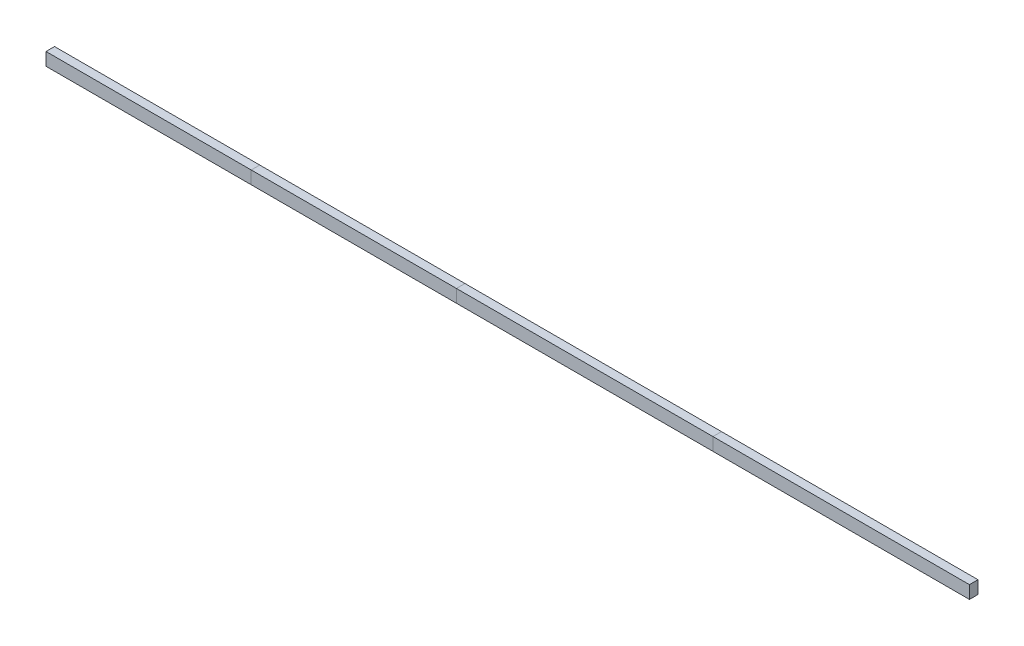
ISO-10303-21;
HEADER;
FILE_DESCRIPTION(('STEP AP214'),'2;1');
FILE_NAME('part.step','',(''),(''),'','','');
FILE_SCHEMA(('AUTOMOTIVE_DESIGN { 1 0 10303 214 1 1 1 1 }'));
ENDSEC;
DATA;
#1=APPLICATION_CONTEXT('core data for automotive mechanical design processes');
#2=APPLICATION_PROTOCOL_DEFINITION('international standard','automotive_design',2000,#1);
#3=PRODUCT_CONTEXT('',#1,'mechanical');
#4=PRODUCT('Part','Part','',(#3));
#5=PRODUCT_RELATED_PRODUCT_CATEGORY('part','',(#4));
#6=PRODUCT_DEFINITION_FORMATION('','',#4);
#7=PRODUCT_DEFINITION_CONTEXT('part definition',#1,'design');
#8=PRODUCT_DEFINITION('design','',#6,#7);
#9=PRODUCT_DEFINITION_SHAPE('','',#8);
#10=(LENGTH_UNIT() NAMED_UNIT(*) SI_UNIT(.MILLI.,.METRE.));
#11=(NAMED_UNIT(*) PLANE_ANGLE_UNIT() SI_UNIT($,.RADIAN.));
#12=(NAMED_UNIT(*) SI_UNIT($,.STERADIAN.) SOLID_ANGLE_UNIT());
#13=UNCERTAINTY_MEASURE_WITH_UNIT(LENGTH_MEASURE(1.E-05),#10,'distance_accuracy_value','');
#14=(GEOMETRIC_REPRESENTATION_CONTEXT(3) GLOBAL_UNCERTAINTY_ASSIGNED_CONTEXT((#13)) GLOBAL_UNIT_ASSIGNED_CONTEXT((#10,
#11,#12)) REPRESENTATION_CONTEXT('',''));
#15=CARTESIAN_POINT('',(0.,0.,0.));
#16=DIRECTION('',(0.,0.,1.));
#17=DIRECTION('',(1.,0.,0.));
#18=AXIS2_PLACEMENT_3D('',#15,#16,#17);
#19=CARTESIAN_POINT('',(5486.4,-38.1,-25.4));
#20=DIRECTION('',(0.,0.,1.));
#21=DIRECTION('',(1.,0.,0.));
#22=AXIS2_PLACEMENT_3D('',#19,#20,#21);
#23=PLANE('',#22);
#24=DIRECTION('',(0.,1.,0.));
#25=VECTOR('',#24,1.);
#26=CARTESIAN_POINT('',(3962.4,-38.1,-25.4));
#27=LINE('',#26,#25);
#28=CARTESIAN_POINT('',(3962.4,-38.1,-25.4));
#29=VERTEX_POINT('',#28);
#30=CARTESIAN_POINT('',(3962.4,38.1,-25.4));
#31=VERTEX_POINT('',#30);
#32=EDGE_CURVE('E115',#29,#31,#27,.T.);
#33=ORIENTED_EDGE('',*,*,#32,.T.);
#34=DIRECTION('',(-1.,0.,0.));
#35=VECTOR('',#34,1.);
#36=CARTESIAN_POINT('',(5486.4,38.1,-25.4));
#37=LINE('',#36,#35);
#38=CARTESIAN_POINT('',(5486.4,38.1,-25.4));
#39=VERTEX_POINT('',#38);
#40=EDGE_CURVE('E12',#39,#31,#37,.T.);
#41=ORIENTED_EDGE('',*,*,#40,.F.);
#42=DIRECTION('',(0.,1.,0.));
#43=VECTOR('',#42,1.);
#44=CARTESIAN_POINT('',(5486.4,-38.1,-25.4));
#45=LINE('',#44,#43);
#46=CARTESIAN_POINT('',(5486.4,-38.1,-25.4));
#47=VERTEX_POINT('',#46);
#48=EDGE_CURVE('E103',#47,#39,#45,.T.);
#49=ORIENTED_EDGE('',*,*,#48,.F.);
#50=DIRECTION('',(-1.,0.,0.));
#51=VECTOR('',#50,1.);
#52=CARTESIAN_POINT('',(5486.4,-38.1,-25.4));
#53=LINE('',#52,#51);
#54=EDGE_CURVE('E111',#47,#29,#53,.T.);
#55=ORIENTED_EDGE('',*,*,#54,.T.);
#56=EDGE_LOOP('',(#33,#41,#49,#55));
#57=FACE_BOUND('',#56,.T.);
#58=ADVANCED_FACE('F52',(#57),#23,.F.);
#59=CARTESIAN_POINT('',(5486.4,38.1,25.4));
#60=DIRECTION('',(0.,-1.,0.));
#61=DIRECTION('',(0.,0.,-1.));
#62=AXIS2_PLACEMENT_3D('',#59,#60,#61);
#63=PLANE('',#62);
#64=DIRECTION('',(0.,0.,1.));
#65=VECTOR('',#64,1.);
#66=CARTESIAN_POINT('',(3962.4,38.1,25.4));
#67=LINE('',#66,#65);
#68=CARTESIAN_POINT('',(3962.4,38.1,25.4));
#69=VERTEX_POINT('',#68);
#70=EDGE_CURVE('E107',#31,#69,#67,.T.);
#71=ORIENTED_EDGE('',*,*,#70,.T.);
#72=DIRECTION('',(-1.,0.,0.));
#73=VECTOR('',#72,1.);
#74=CARTESIAN_POINT('',(5486.4,38.1,25.4));
#75=LINE('',#74,#73);
#76=CARTESIAN_POINT('',(5486.4,38.1,25.4));
#77=VERTEX_POINT('',#76);
#78=EDGE_CURVE('E60',#77,#69,#75,.T.);
#79=ORIENTED_EDGE('',*,*,#78,.F.);
#80=DIRECTION('',(0.,0.,1.));
#81=VECTOR('',#80,1.);
#82=CARTESIAN_POINT('',(5486.4,38.1,25.4));
#83=LINE('',#82,#81);
#84=EDGE_CURVE('E98',#39,#77,#83,.T.);
#85=ORIENTED_EDGE('',*,*,#84,.F.);
#86=ORIENTED_EDGE('',*,*,#40,.T.);
#87=EDGE_LOOP('',(#71,#79,#85,#86));
#88=FACE_BOUND('',#87,.T.);
#89=ADVANCED_FACE('F106',(#88),#63,.F.);
#90=CARTESIAN_POINT('',(5486.4,-38.1,25.4));
#91=DIRECTION('',(0.,0.,-1.));
#92=DIRECTION('',(-1.,0.,0.));
#93=AXIS2_PLACEMENT_3D('',#90,#91,#92);
#94=PLANE('',#93);
#95=DIRECTION('',(0.,-1.,0.));
#96=VECTOR('',#95,1.);
#97=CARTESIAN_POINT('',(3962.4,-38.1,25.4));
#98=LINE('',#97,#96);
#99=CARTESIAN_POINT('',(3962.4,-38.1,25.4));
#100=VERTEX_POINT('',#99);
#101=EDGE_CURVE('E85',#69,#100,#98,.T.);
#102=ORIENTED_EDGE('',*,*,#101,.T.);
#103=DIRECTION('',(-1.,0.,0.));
#104=VECTOR('',#103,1.);
#105=CARTESIAN_POINT('',(5486.4,-38.1,25.4));
#106=LINE('',#105,#104);
#107=CARTESIAN_POINT('',(5486.4,-38.1,25.4));
#108=VERTEX_POINT('',#107);
#109=EDGE_CURVE('E108',#108,#100,#106,.T.);
#110=ORIENTED_EDGE('',*,*,#109,.F.);
#111=DIRECTION('',(0.,-1.,0.));
#112=VECTOR('',#111,1.);
#113=CARTESIAN_POINT('',(5486.4,-38.1,25.4));
#114=LINE('',#113,#112);
#115=EDGE_CURVE('E101',#77,#108,#114,.T.);
#116=ORIENTED_EDGE('',*,*,#115,.F.);
#117=ORIENTED_EDGE('',*,*,#78,.T.);
#118=EDGE_LOOP('',(#102,#110,#116,#117));
#119=FACE_BOUND('',#118,.T.);
#120=ADVANCED_FACE('F109',(#119),#94,.F.);
#121=CARTESIAN_POINT('',(5486.4,-38.1,25.4));
#122=DIRECTION('',(0.,1.,0.));
#123=DIRECTION('',(0.,0.,1.));
#124=AXIS2_PLACEMENT_3D('',#121,#122,#123);
#125=PLANE('',#124);
#126=DIRECTION('',(0.,0.,-1.));
#127=VECTOR('',#126,1.);
#128=CARTESIAN_POINT('',(3962.4,-38.1,25.4));
#129=LINE('',#128,#127);
#130=EDGE_CURVE('E91',#100,#29,#129,.T.);
#131=ORIENTED_EDGE('',*,*,#130,.T.);
#132=ORIENTED_EDGE('',*,*,#54,.F.);
#133=DIRECTION('',(0.,0.,-1.));
#134=VECTOR('',#133,1.);
#135=CARTESIAN_POINT('',(5486.4,-38.1,25.4));
#136=LINE('',#135,#134);
#137=EDGE_CURVE('E68',#108,#47,#136,.T.);
#138=ORIENTED_EDGE('',*,*,#137,.F.);
#139=ORIENTED_EDGE('',*,*,#109,.T.);
#140=EDGE_LOOP('',(#131,#132,#138,#139));
#141=FACE_BOUND('',#140,.T.);
#142=ADVANCED_FACE('F122',(#141),#125,.F.);
#143=CARTESIAN_POINT('',(5486.4,0.,0.));
#144=DIRECTION('',(-1.,0.,0.));
#145=DIRECTION('',(0.,0.,1.));
#146=AXIS2_PLACEMENT_3D('',#143,#144,#145);
#147=PLANE('',#146);
#148=ORIENTED_EDGE('',*,*,#48,.T.);
#149=ORIENTED_EDGE('',*,*,#84,.T.);
#150=ORIENTED_EDGE('',*,*,#115,.T.);
#151=ORIENTED_EDGE('',*,*,#137,.T.);
#152=EDGE_LOOP('',(#148,#149,#150,#151));
#153=FACE_BOUND('',#152,.T.);
#154=ADVANCED_FACE('F99',(#153),#147,.F.);
#155=CARTESIAN_POINT('',(3962.4,0.,0.));
#156=DIRECTION('',(-1.,0.,0.));
#157=DIRECTION('',(0.,0.,1.));
#158=AXIS2_PLACEMENT_3D('',#155,#156,#157);
#159=PLANE('',#158);
#160=ORIENTED_EDGE('',*,*,#32,.F.);
#161=ORIENTED_EDGE('',*,*,#130,.F.);
#162=ORIENTED_EDGE('',*,*,#101,.F.);
#163=ORIENTED_EDGE('',*,*,#70,.F.);
#164=EDGE_LOOP('',(#160,#161,#162,#163));
#165=FACE_BOUND('',#164,.T.);
#166=ADVANCED_FACE('F125',(#165),#159,.T.);
#167=CLOSED_SHELL('',(#58,#89,#120,#142,#154,#166));
#168=MANIFOLD_SOLID_BREP('B2',#167);
#169=CARTESIAN_POINT('',(3962.4,-38.1,-25.4));
#170=DIRECTION('',(0.,0.,1.));
#171=DIRECTION('',(1.,0.,0.));
#172=AXIS2_PLACEMENT_3D('',#169,#170,#171);
#173=PLANE('',#172);
#174=DIRECTION('',(0.,1.,0.));
#175=VECTOR('',#174,1.);
#176=CARTESIAN_POINT('',(2438.4,-38.1,-25.4));
#177=LINE('',#176,#175);
#178=CARTESIAN_POINT('',(2438.4,-38.1,-25.4));
#179=VERTEX_POINT('',#178);
#180=CARTESIAN_POINT('',(2438.4,38.1,-25.4));
#181=VERTEX_POINT('',#180);
#182=EDGE_CURVE('E254',#179,#181,#177,.T.);
#183=ORIENTED_EDGE('',*,*,#182,.T.);
#184=DIRECTION('',(-1.,0.,0.));
#185=VECTOR('',#184,1.);
#186=CARTESIAN_POINT('',(3962.4,38.1,-25.4));
#187=LINE('',#186,#185);
#188=CARTESIAN_POINT('',(3962.4,38.1,-25.4));
#189=VERTEX_POINT('',#188);
#190=EDGE_CURVE('E50',#189,#181,#187,.T.);
#191=ORIENTED_EDGE('',*,*,#190,.F.);
#192=DIRECTION('',(0.,1.,0.));
#193=VECTOR('',#192,1.);
#194=CARTESIAN_POINT('',(3962.4,-38.1,-25.4));
#195=LINE('',#194,#193);
#196=CARTESIAN_POINT('',(3962.4,-38.1,-25.4));
#197=VERTEX_POINT('',#196);
#198=EDGE_CURVE('E238',#197,#189,#195,.T.);
#199=ORIENTED_EDGE('',*,*,#198,.F.);
#200=DIRECTION('',(-1.,0.,0.));
#201=VECTOR('',#200,1.);
#202=CARTESIAN_POINT('',(3962.4,-38.1,-25.4));
#203=LINE('',#202,#201);
#204=EDGE_CURVE('E250',#197,#179,#203,.T.);
#205=ORIENTED_EDGE('',*,*,#204,.T.);
#206=EDGE_LOOP('',(#183,#191,#199,#205));
#207=FACE_BOUND('',#206,.T.);
#208=ADVANCED_FACE('F186',(#207),#173,.F.);
#209=CARTESIAN_POINT('',(3962.4,38.1,25.4));
#210=DIRECTION('',(0.,-1.,0.));
#211=DIRECTION('',(0.,0.,-1.));
#212=AXIS2_PLACEMENT_3D('',#209,#210,#211);
#213=PLANE('',#212);
#214=DIRECTION('',(0.,0.,1.));
#215=VECTOR('',#214,1.);
#216=CARTESIAN_POINT('',(2438.4,38.1,25.4));
#217=LINE('',#216,#215);
#218=CARTESIAN_POINT('',(2438.4,38.1,25.4));
#219=VERTEX_POINT('',#218);
#220=EDGE_CURVE('E243',#181,#219,#217,.T.);
#221=ORIENTED_EDGE('',*,*,#220,.T.);
#222=DIRECTION('',(-1.,0.,0.));
#223=VECTOR('',#222,1.);
#224=CARTESIAN_POINT('',(3962.4,38.1,25.4));
#225=LINE('',#224,#223);
#226=CARTESIAN_POINT('',(3962.4,38.1,25.4));
#227=VERTEX_POINT('',#226);
#228=EDGE_CURVE('E195',#227,#219,#225,.T.);
#229=ORIENTED_EDGE('',*,*,#228,.F.);
#230=DIRECTION('',(0.,0.,1.));
#231=VECTOR('',#230,1.);
#232=CARTESIAN_POINT('',(3962.4,38.1,25.4));
#233=LINE('',#232,#231);
#234=EDGE_CURVE('E233',#189,#227,#233,.T.);
#235=ORIENTED_EDGE('',*,*,#234,.F.);
#236=ORIENTED_EDGE('',*,*,#190,.T.);
#237=EDGE_LOOP('',(#221,#229,#235,#236));
#238=FACE_BOUND('',#237,.T.);
#239=ADVANCED_FACE('F242',(#238),#213,.F.);
#240=CARTESIAN_POINT('',(3962.4,-38.1,25.4));
#241=DIRECTION('',(0.,0.,-1.));
#242=DIRECTION('',(-1.,0.,0.));
#243=AXIS2_PLACEMENT_3D('',#240,#241,#242);
#244=PLANE('',#243);
#245=DIRECTION('',(0.,-1.,0.));
#246=VECTOR('',#245,1.);
#247=CARTESIAN_POINT('',(2438.4,-38.1,25.4));
#248=LINE('',#247,#246);
#249=CARTESIAN_POINT('',(2438.4,-38.1,25.4));
#250=VERTEX_POINT('',#249);
#251=EDGE_CURVE('E220',#219,#250,#248,.T.);
#252=ORIENTED_EDGE('',*,*,#251,.T.);
#253=DIRECTION('',(-1.,0.,0.));
#254=VECTOR('',#253,1.);
#255=CARTESIAN_POINT('',(3962.4,-38.1,25.4));
#256=LINE('',#255,#254);
#257=CARTESIAN_POINT('',(3962.4,-38.1,25.4));
#258=VERTEX_POINT('',#257);
#259=EDGE_CURVE('E245',#258,#250,#256,.T.);
#260=ORIENTED_EDGE('',*,*,#259,.F.);
#261=DIRECTION('',(0.,-1.,0.));
#262=VECTOR('',#261,1.);
#263=CARTESIAN_POINT('',(3962.4,-38.1,25.4));
#264=LINE('',#263,#262);
#265=EDGE_CURVE('E236',#227,#258,#264,.T.);
#266=ORIENTED_EDGE('',*,*,#265,.F.);
#267=ORIENTED_EDGE('',*,*,#228,.T.);
#268=EDGE_LOOP('',(#252,#260,#266,#267));
#269=FACE_BOUND('',#268,.T.);
#270=ADVANCED_FACE('F246',(#269),#244,.F.);
#271=CARTESIAN_POINT('',(3962.4,-38.1,25.4));
#272=DIRECTION('',(0.,1.,0.));
#273=DIRECTION('',(0.,0.,1.));
#274=AXIS2_PLACEMENT_3D('',#271,#272,#273);
#275=PLANE('',#274);
#276=DIRECTION('',(0.,0.,-1.));
#277=VECTOR('',#276,1.);
#278=CARTESIAN_POINT('',(2438.4,-38.1,25.4));
#279=LINE('',#278,#277);
#280=EDGE_CURVE('E226',#250,#179,#279,.T.);
#281=ORIENTED_EDGE('',*,*,#280,.T.);
#282=ORIENTED_EDGE('',*,*,#204,.F.);
#283=DIRECTION('',(0.,0.,-1.));
#284=VECTOR('',#283,1.);
#285=CARTESIAN_POINT('',(3962.4,-38.1,25.4));
#286=LINE('',#285,#284);
#287=EDGE_CURVE('E203',#258,#197,#286,.T.);
#288=ORIENTED_EDGE('',*,*,#287,.F.);
#289=ORIENTED_EDGE('',*,*,#259,.T.);
#290=EDGE_LOOP('',(#281,#282,#288,#289));
#291=FACE_BOUND('',#290,.T.);
#292=ADVANCED_FACE('F267',(#291),#275,.F.);
#293=CARTESIAN_POINT('',(3962.4,0.,0.));
#294=DIRECTION('',(-1.,0.,0.));
#295=DIRECTION('',(0.,0.,1.));
#296=AXIS2_PLACEMENT_3D('',#293,#294,#295);
#297=PLANE('',#296);
#298=ORIENTED_EDGE('',*,*,#198,.T.);
#299=ORIENTED_EDGE('',*,*,#234,.T.);
#300=ORIENTED_EDGE('',*,*,#265,.T.);
#301=ORIENTED_EDGE('',*,*,#287,.T.);
#302=EDGE_LOOP('',(#298,#299,#300,#301));
#303=FACE_BOUND('',#302,.T.);
#304=ADVANCED_FACE('F234',(#303),#297,.F.);
#305=CARTESIAN_POINT('',(2438.4,0.,0.));
#306=DIRECTION('',(-1.,0.,0.));
#307=DIRECTION('',(0.,0.,1.));
#308=AXIS2_PLACEMENT_3D('',#305,#306,#307);
#309=PLANE('',#308);
#310=ORIENTED_EDGE('',*,*,#182,.F.);
#311=ORIENTED_EDGE('',*,*,#280,.F.);
#312=ORIENTED_EDGE('',*,*,#251,.F.);
#313=ORIENTED_EDGE('',*,*,#220,.F.);
#314=EDGE_LOOP('',(#310,#311,#312,#313));
#315=FACE_BOUND('',#314,.T.);
#316=ADVANCED_FACE('F270',(#315),#309,.T.);
#317=CLOSED_SHELL('',(#208,#239,#270,#292,#304,#316));
#318=MANIFOLD_SOLID_BREP('B6',#317);
#319=CARTESIAN_POINT('',(2438.4,-38.1,-25.4));
#320=DIRECTION('',(0.,0.,1.));
#321=DIRECTION('',(1.,0.,0.));
#322=AXIS2_PLACEMENT_3D('',#319,#320,#321);
#323=PLANE('',#322);
#324=DIRECTION('',(0.,1.,0.));
#325=VECTOR('',#324,1.);
#326=CARTESIAN_POINT('',(1219.2,-38.1,-25.4));
#327=LINE('',#326,#325);
#328=CARTESIAN_POINT('',(1219.2,-38.1,-25.4));
#329=VERTEX_POINT('',#328);
#330=CARTESIAN_POINT('',(1219.2,38.1,-25.4));
#331=VERTEX_POINT('',#330);
#332=EDGE_CURVE('E394',#329,#331,#327,.T.);
#333=ORIENTED_EDGE('',*,*,#332,.T.);
#334=DIRECTION('',(-1.,0.,0.));
#335=VECTOR('',#334,1.);
#336=CARTESIAN_POINT('',(2438.4,38.1,-25.4));
#337=LINE('',#336,#335);
#338=CARTESIAN_POINT('',(2438.4,38.1,-25.4));
#339=VERTEX_POINT('',#338);
#340=EDGE_CURVE('E184',#339,#331,#337,.T.);
#341=ORIENTED_EDGE('',*,*,#340,.F.);
#342=DIRECTION('',(0.,1.,0.));
#343=VECTOR('',#342,1.);
#344=CARTESIAN_POINT('',(2438.4,-38.1,-25.4));
#345=LINE('',#344,#343);
#346=CARTESIAN_POINT('',(2438.4,-38.1,-25.4));
#347=VERTEX_POINT('',#346);
#348=EDGE_CURVE('E382',#347,#339,#345,.T.);
#349=ORIENTED_EDGE('',*,*,#348,.F.);
#350=DIRECTION('',(-1.,0.,0.));
#351=VECTOR('',#350,1.);
#352=CARTESIAN_POINT('',(2438.4,-38.1,-25.4));
#353=LINE('',#352,#351);
#354=EDGE_CURVE('E390',#347,#329,#353,.T.);
#355=ORIENTED_EDGE('',*,*,#354,.T.);
#356=EDGE_LOOP('',(#333,#341,#349,#355));
#357=FACE_BOUND('',#356,.T.);
#358=ADVANCED_FACE('F331',(#357),#323,.F.);
#359=CARTESIAN_POINT('',(2438.4,38.1,25.4));
#360=DIRECTION('',(0.,-1.,0.));
#361=DIRECTION('',(0.,0.,-1.));
#362=AXIS2_PLACEMENT_3D('',#359,#360,#361);
#363=PLANE('',#362);
#364=DIRECTION('',(0.,0.,1.));
#365=VECTOR('',#364,1.);
#366=CARTESIAN_POINT('',(1219.2,38.1,25.4));
#367=LINE('',#366,#365);
#368=CARTESIAN_POINT('',(1219.2,38.1,25.4));
#369=VERTEX_POINT('',#368);
#370=EDGE_CURVE('E386',#331,#369,#367,.T.);
#371=ORIENTED_EDGE('',*,*,#370,.T.);
#372=DIRECTION('',(-1.,0.,0.));
#373=VECTOR('',#372,1.);
#374=CARTESIAN_POINT('',(2438.4,38.1,25.4));
#375=LINE('',#374,#373);
#376=CARTESIAN_POINT('',(2438.4,38.1,25.4));
#377=VERTEX_POINT('',#376);
#378=EDGE_CURVE('E339',#377,#369,#375,.T.);
#379=ORIENTED_EDGE('',*,*,#378,.F.);
#380=DIRECTION('',(0.,0.,1.));
#381=VECTOR('',#380,1.);
#382=CARTESIAN_POINT('',(2438.4,38.1,25.4));
#383=LINE('',#382,#381);
#384=EDGE_CURVE('E377',#339,#377,#383,.T.);
#385=ORIENTED_EDGE('',*,*,#384,.F.);
#386=ORIENTED_EDGE('',*,*,#340,.T.);
#387=EDGE_LOOP('',(#371,#379,#385,#386));
#388=FACE_BOUND('',#387,.T.);
#389=ADVANCED_FACE('F385',(#388),#363,.F.);
#390=CARTESIAN_POINT('',(2438.4,-38.1,25.4));
#391=DIRECTION('',(0.,0.,-1.));
#392=DIRECTION('',(-1.,0.,0.));
#393=AXIS2_PLACEMENT_3D('',#390,#391,#392);
#394=PLANE('',#393);
#395=DIRECTION('',(0.,-1.,0.));
#396=VECTOR('',#395,1.);
#397=CARTESIAN_POINT('',(1219.2,-38.1,25.4));
#398=LINE('',#397,#396);
#399=CARTESIAN_POINT('',(1219.2,-38.1,25.4));
#400=VERTEX_POINT('',#399);
#401=EDGE_CURVE('E364',#369,#400,#398,.T.);
#402=ORIENTED_EDGE('',*,*,#401,.T.);
#403=DIRECTION('',(-1.,0.,0.));
#404=VECTOR('',#403,1.);
#405=CARTESIAN_POINT('',(2438.4,-38.1,25.4));
#406=LINE('',#405,#404);
#407=CARTESIAN_POINT('',(2438.4,-38.1,25.4));
#408=VERTEX_POINT('',#407);
#409=EDGE_CURVE('E387',#408,#400,#406,.T.);
#410=ORIENTED_EDGE('',*,*,#409,.F.);
#411=DIRECTION('',(0.,-1.,0.));
#412=VECTOR('',#411,1.);
#413=CARTESIAN_POINT('',(2438.4,-38.1,25.4));
#414=LINE('',#413,#412);
#415=EDGE_CURVE('E380',#377,#408,#414,.T.);
#416=ORIENTED_EDGE('',*,*,#415,.F.);
#417=ORIENTED_EDGE('',*,*,#378,.T.);
#418=EDGE_LOOP('',(#402,#410,#416,#417));
#419=FACE_BOUND('',#418,.T.);
#420=ADVANCED_FACE('F388',(#419),#394,.F.);
#421=CARTESIAN_POINT('',(2438.4,-38.1,25.4));
#422=DIRECTION('',(0.,1.,0.));
#423=DIRECTION('',(0.,0.,1.));
#424=AXIS2_PLACEMENT_3D('',#421,#422,#423);
#425=PLANE('',#424);
#426=DIRECTION('',(0.,0.,-1.));
#427=VECTOR('',#426,1.);
#428=CARTESIAN_POINT('',(1219.2,-38.1,25.4));
#429=LINE('',#428,#427);
#430=EDGE_CURVE('E370',#400,#329,#429,.T.);
#431=ORIENTED_EDGE('',*,*,#430,.T.);
#432=ORIENTED_EDGE('',*,*,#354,.F.);
#433=DIRECTION('',(0.,0.,-1.));
#434=VECTOR('',#433,1.);
#435=CARTESIAN_POINT('',(2438.4,-38.1,25.4));
#436=LINE('',#435,#434);
#437=EDGE_CURVE('E347',#408,#347,#436,.T.);
#438=ORIENTED_EDGE('',*,*,#437,.F.);
#439=ORIENTED_EDGE('',*,*,#409,.T.);
#440=EDGE_LOOP('',(#431,#432,#438,#439));
#441=FACE_BOUND('',#440,.T.);
#442=ADVANCED_FACE('F401',(#441),#425,.F.);
#443=CARTESIAN_POINT('',(2438.4,0.,0.));
#444=DIRECTION('',(-1.,0.,0.));
#445=DIRECTION('',(0.,0.,1.));
#446=AXIS2_PLACEMENT_3D('',#443,#444,#445);
#447=PLANE('',#446);
#448=ORIENTED_EDGE('',*,*,#348,.T.);
#449=ORIENTED_EDGE('',*,*,#384,.T.);
#450=ORIENTED_EDGE('',*,*,#415,.T.);
#451=ORIENTED_EDGE('',*,*,#437,.T.);
#452=EDGE_LOOP('',(#448,#449,#450,#451));
#453=FACE_BOUND('',#452,.T.);
#454=ADVANCED_FACE('F378',(#453),#447,.F.);
#455=CARTESIAN_POINT('',(1219.2,0.,0.));
#456=DIRECTION('',(-1.,0.,0.));
#457=DIRECTION('',(0.,0.,1.));
#458=AXIS2_PLACEMENT_3D('',#455,#456,#457);
#459=PLANE('',#458);
#460=ORIENTED_EDGE('',*,*,#332,.F.);
#461=ORIENTED_EDGE('',*,*,#430,.F.);
#462=ORIENTED_EDGE('',*,*,#401,.F.);
#463=ORIENTED_EDGE('',*,*,#370,.F.);
#464=EDGE_LOOP('',(#460,#461,#462,#463));
#465=FACE_BOUND('',#464,.T.);
#466=ADVANCED_FACE('F404',(#465),#459,.T.);
#467=CLOSED_SHELL('',(#358,#389,#420,#442,#454,#466));
#468=MANIFOLD_SOLID_BREP('B44',#467);
#469=CARTESIAN_POINT('',(1219.2,-38.1,-25.4));
#470=DIRECTION('',(0.,0.,1.));
#471=DIRECTION('',(1.,0.,0.));
#472=AXIS2_PLACEMENT_3D('',#469,#470,#471);
#473=PLANE('',#472);
#474=DIRECTION('',(0.,1.,0.));
#475=VECTOR('',#474,1.);
#476=CARTESIAN_POINT('',(0.,-38.1,-25.4));
#477=LINE('',#476,#475);
#478=CARTESIAN_POINT('',(0.,-38.1,-25.4));
#479=VERTEX_POINT('',#478);
#480=CARTESIAN_POINT('',(0.,38.1,-25.4));
#481=VERTEX_POINT('',#480);
#482=EDGE_CURVE('E518',#479,#481,#477,.T.);
#483=ORIENTED_EDGE('',*,*,#482,.T.);
#484=DIRECTION('',(-1.,0.,0.));
#485=VECTOR('',#484,1.);
#486=CARTESIAN_POINT('',(1219.2,38.1,-25.4));
#487=LINE('',#486,#485);
#488=CARTESIAN_POINT('',(1219.2,38.1,-25.4));
#489=VERTEX_POINT('',#488);
#490=EDGE_CURVE('E329',#489,#481,#487,.T.);
#491=ORIENTED_EDGE('',*,*,#490,.F.);
#492=DIRECTION('',(0.,1.,0.));
#493=VECTOR('',#492,1.);
#494=CARTESIAN_POINT('',(1219.2,-38.1,-25.4));
#495=LINE('',#494,#493);
#496=CARTESIAN_POINT('',(1219.2,-38.1,-25.4));
#497=VERTEX_POINT('',#496);
#498=EDGE_CURVE('E506',#497,#489,#495,.T.);
#499=ORIENTED_EDGE('',*,*,#498,.F.);
#500=DIRECTION('',(-1.,0.,0.));
#501=VECTOR('',#500,1.);
#502=CARTESIAN_POINT('',(1219.2,-38.1,-25.4));
#503=LINE('',#502,#501);
#504=EDGE_CURVE('E514',#497,#479,#503,.T.);
#505=ORIENTED_EDGE('',*,*,#504,.T.);
#506=EDGE_LOOP('',(#483,#491,#499,#505));
#507=FACE_BOUND('',#506,.T.);
#508=ADVANCED_FACE('F455',(#507),#473,.F.);
#509=CARTESIAN_POINT('',(1219.2,38.1,25.4));
#510=DIRECTION('',(0.,-1.,0.));
#511=DIRECTION('',(0.,0.,-1.));
#512=AXIS2_PLACEMENT_3D('',#509,#510,#511);
#513=PLANE('',#512);
#514=DIRECTION('',(0.,0.,1.));
#515=VECTOR('',#514,1.);
#516=CARTESIAN_POINT('',(0.,38.1,25.4));
#517=LINE('',#516,#515);
#518=CARTESIAN_POINT('',(0.,38.1,25.4));
#519=VERTEX_POINT('',#518);
#520=EDGE_CURVE('E510',#481,#519,#517,.T.);
#521=ORIENTED_EDGE('',*,*,#520,.T.);
#522=DIRECTION('',(-1.,0.,0.));
#523=VECTOR('',#522,1.);
#524=CARTESIAN_POINT('',(1219.2,38.1,25.4));
#525=LINE('',#524,#523);
#526=CARTESIAN_POINT('',(1219.2,38.1,25.4));
#527=VERTEX_POINT('',#526);
#528=EDGE_CURVE('E463',#527,#519,#525,.T.);
#529=ORIENTED_EDGE('',*,*,#528,.F.);
#530=DIRECTION('',(0.,0.,1.));
#531=VECTOR('',#530,1.);
#532=CARTESIAN_POINT('',(1219.2,38.1,25.4));
#533=LINE('',#532,#531);
#534=EDGE_CURVE('E501',#489,#527,#533,.T.);
#535=ORIENTED_EDGE('',*,*,#534,.F.);
#536=ORIENTED_EDGE('',*,*,#490,.T.);
#537=EDGE_LOOP('',(#521,#529,#535,#536));
#538=FACE_BOUND('',#537,.T.);
#539=ADVANCED_FACE('F509',(#538),#513,.F.);
#540=CARTESIAN_POINT('',(1219.2,-38.1,25.4));
#541=DIRECTION('',(0.,0.,-1.));
#542=DIRECTION('',(-1.,0.,0.));
#543=AXIS2_PLACEMENT_3D('',#540,#541,#542);
#544=PLANE('',#543);
#545=DIRECTION('',(0.,-1.,0.));
#546=VECTOR('',#545,1.);
#547=CARTESIAN_POINT('',(0.,-38.1,25.4));
#548=LINE('',#547,#546);
#549=CARTESIAN_POINT('',(0.,-38.1,25.4));
#550=VERTEX_POINT('',#549);
#551=EDGE_CURVE('E488',#519,#550,#548,.T.);
#552=ORIENTED_EDGE('',*,*,#551,.T.);
#553=DIRECTION('',(-1.,0.,0.));
#554=VECTOR('',#553,1.);
#555=CARTESIAN_POINT('',(1219.2,-38.1,25.4));
#556=LINE('',#555,#554);
#557=CARTESIAN_POINT('',(1219.2,-38.1,25.4));
#558=VERTEX_POINT('',#557);
#559=EDGE_CURVE('E511',#558,#550,#556,.T.);
#560=ORIENTED_EDGE('',*,*,#559,.F.);
#561=DIRECTION('',(0.,-1.,0.));
#562=VECTOR('',#561,1.);
#563=CARTESIAN_POINT('',(1219.2,-38.1,25.4));
#564=LINE('',#563,#562);
#565=EDGE_CURVE('E504',#527,#558,#564,.T.);
#566=ORIENTED_EDGE('',*,*,#565,.F.);
#567=ORIENTED_EDGE('',*,*,#528,.T.);
#568=EDGE_LOOP('',(#552,#560,#566,#567));
#569=FACE_BOUND('',#568,.T.);
#570=ADVANCED_FACE('F512',(#569),#544,.F.);
#571=CARTESIAN_POINT('',(1219.2,-38.1,25.4));
#572=DIRECTION('',(0.,1.,0.));
#573=DIRECTION('',(0.,0.,1.));
#574=AXIS2_PLACEMENT_3D('',#571,#572,#573);
#575=PLANE('',#574);
#576=DIRECTION('',(0.,0.,-1.));
#577=VECTOR('',#576,1.);
#578=CARTESIAN_POINT('',(0.,-38.1,25.4));
#579=LINE('',#578,#577);
#580=EDGE_CURVE('E494',#550,#479,#579,.T.);
#581=ORIENTED_EDGE('',*,*,#580,.T.);
#582=ORIENTED_EDGE('',*,*,#504,.F.);
#583=DIRECTION('',(0.,0.,-1.));
#584=VECTOR('',#583,1.);
#585=CARTESIAN_POINT('',(1219.2,-38.1,25.4));
#586=LINE('',#585,#584);
#587=EDGE_CURVE('E471',#558,#497,#586,.T.);
#588=ORIENTED_EDGE('',*,*,#587,.F.);
#589=ORIENTED_EDGE('',*,*,#559,.T.);
#590=EDGE_LOOP('',(#581,#582,#588,#589));
#591=FACE_BOUND('',#590,.T.);
#592=ADVANCED_FACE('F525',(#591),#575,.F.);
#593=CARTESIAN_POINT('',(1219.2,0.,0.));
#594=DIRECTION('',(-1.,0.,0.));
#595=DIRECTION('',(0.,0.,1.));
#596=AXIS2_PLACEMENT_3D('',#593,#594,#595);
#597=PLANE('',#596);
#598=ORIENTED_EDGE('',*,*,#498,.T.);
#599=ORIENTED_EDGE('',*,*,#534,.T.);
#600=ORIENTED_EDGE('',*,*,#565,.T.);
#601=ORIENTED_EDGE('',*,*,#587,.T.);
#602=EDGE_LOOP('',(#598,#599,#600,#601));
#603=FACE_BOUND('',#602,.T.);
#604=ADVANCED_FACE('F502',(#603),#597,.F.);
#605=CARTESIAN_POINT('',(0.,0.,0.));
#606=DIRECTION('',(-1.,0.,0.));
#607=DIRECTION('',(0.,0.,1.));
#608=AXIS2_PLACEMENT_3D('',#605,#606,#607);
#609=PLANE('',#608);
#610=ORIENTED_EDGE('',*,*,#482,.F.);
#611=ORIENTED_EDGE('',*,*,#580,.F.);
#612=ORIENTED_EDGE('',*,*,#551,.F.);
#613=ORIENTED_EDGE('',*,*,#520,.F.);
#614=EDGE_LOOP('',(#610,#611,#612,#613));
#615=FACE_BOUND('',#614,.T.);
#616=ADVANCED_FACE('F528',(#615),#609,.T.);
#617=CLOSED_SHELL('',(#508,#539,#570,#592,#604,#616));
#618=MANIFOLD_SOLID_BREP('B178',#617);
#619=ADVANCED_BREP_SHAPE_REPRESENTATION('',(#18,#168,#318,#468,#618),#14);
#620=SHAPE_DEFINITION_REPRESENTATION(#9,#619);
ENDSEC;
END-ISO-10303-21;
